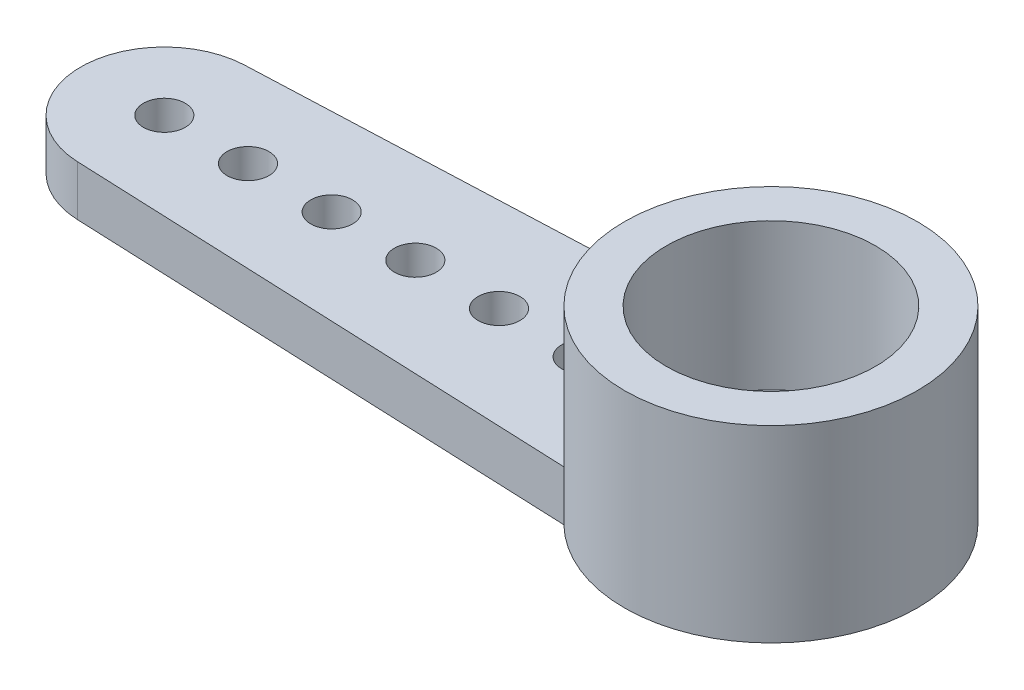
ISO-10303-21;
HEADER;
FILE_DESCRIPTION(('STEP AP214'),'2;1');
FILE_NAME('part.step','',(''),(''),'','','');
FILE_SCHEMA(('AUTOMOTIVE_DESIGN { 1 0 10303 214 1 1 1 1 }'));
ENDSEC;
DATA;
#1=APPLICATION_CONTEXT('core data for automotive mechanical design processes');
#2=APPLICATION_PROTOCOL_DEFINITION('international standard','automotive_design',2000,#1);
#3=PRODUCT_CONTEXT('',#1,'mechanical');
#4=PRODUCT('Part','Part','',(#3));
#5=PRODUCT_RELATED_PRODUCT_CATEGORY('part','',(#4));
#6=PRODUCT_DEFINITION_FORMATION('','',#4);
#7=PRODUCT_DEFINITION_CONTEXT('part definition',#1,'design');
#8=PRODUCT_DEFINITION('design','',#6,#7);
#9=PRODUCT_DEFINITION_SHAPE('','',#8);
#10=(LENGTH_UNIT() NAMED_UNIT(*) SI_UNIT(.MILLI.,.METRE.));
#11=(NAMED_UNIT(*) PLANE_ANGLE_UNIT() SI_UNIT($,.RADIAN.));
#12=(NAMED_UNIT(*) SI_UNIT($,.STERADIAN.) SOLID_ANGLE_UNIT());
#13=UNCERTAINTY_MEASURE_WITH_UNIT(LENGTH_MEASURE(1.E-05),#10,'distance_accuracy_value','');
#14=(GEOMETRIC_REPRESENTATION_CONTEXT(3) GLOBAL_UNCERTAINTY_ASSIGNED_CONTEXT((#13)) GLOBAL_UNIT_ASSIGNED_CONTEXT((#10,
#11,#12)) REPRESENTATION_CONTEXT('',''));
#15=CARTESIAN_POINT('',(0.,0.,0.));
#16=DIRECTION('',(0.,0.,1.));
#17=DIRECTION('',(1.,0.,0.));
#18=AXIS2_PLACEMENT_3D('',#15,#16,#17);
#19=CARTESIAN_POINT('',(-0.0955347726602722,1.2,-2.30341215095561));
#20=DIRECTION('',(-0.0414397001813394,0.,-0.999141006689687));
#21=DIRECTION('',(-0.999141006689687,0.,0.0414397001813394));
#22=AXIS2_PLACEMENT_3D('',#19,#20,#21);
#23=PLANE('',#22);
#24=DIRECTION('',(0.999141006689687,0.,-0.0414397001813394));
#25=VECTOR('',#24,1.);
#26=CARTESIAN_POINT('',(-0.0955347726602722,0.,-2.30341215095561));
#27=LINE('',#26,#25);
#28=CARTESIAN_POINT('',(-7.45244207399663,0.,-1.99828201337937));
#29=VERTEX_POINT('',#28);
#30=CARTESIAN_POINT('',(4.68256680281766,0.,-2.50158547724097));
#31=VERTEX_POINT('',#30);
#32=EDGE_CURVE('E84',#29,#31,#27,.T.);
#33=ORIENTED_EDGE('',*,*,#32,.F.);
#34=DIRECTION('',(0.,-1.,0.));
#35=VECTOR('',#34,1.);
#36=CARTESIAN_POINT('',(-7.45244207399663,1.2,-1.99828201337937));
#37=LINE('',#36,#35);
#38=CARTESIAN_POINT('',(-7.45244207399663,1.2,-1.99828201337937));
#39=VERTEX_POINT('',#38);
#40=EDGE_CURVE('E126',#39,#29,#37,.T.);
#41=ORIENTED_EDGE('',*,*,#40,.F.);
#42=DIRECTION('',(0.999141006689687,0.,-0.0414397001813394));
#43=VECTOR('',#42,1.);
#44=CARTESIAN_POINT('',(-0.0955347726602722,1.2,-2.30341215095561));
#45=LINE('',#44,#43);
#46=CARTESIAN_POINT('',(4.68256680281766,1.2,-2.50158547724097));
#47=VERTEX_POINT('',#46);
#48=EDGE_CURVE('E130',#39,#47,#45,.T.);
#49=ORIENTED_EDGE('',*,*,#48,.T.);
#50=DIRECTION('',(0.,-1.,0.));
#51=VECTOR('',#50,1.);
#52=CARTESIAN_POINT('',(4.68256680281766,1.2,-2.50158547724097));
#53=LINE('',#52,#51);
#54=EDGE_CURVE('E52',#47,#31,#53,.T.);
#55=ORIENTED_EDGE('',*,*,#54,.T.);
#56=EDGE_LOOP('',(#33,#41,#49,#55));
#57=FACE_BOUND('',#56,.T.);
#58=ADVANCED_FACE('F43',(#57),#23,.T.);
#59=CARTESIAN_POINT('',(-7.36956267363395,1.2,0.));
#60=DIRECTION('',(0.,-1.,0.));
#61=DIRECTION('',(0.,0.,-1.));
#62=AXIS2_PLACEMENT_3D('',#59,#60,#61);
#63=CYLINDRICAL_SURFACE('',#62,2.);
#64=CARTESIAN_POINT('',(-7.36956267363395,0.,0.));
#65=DIRECTION('',(0.,1.,0.));
#66=DIRECTION('',(0.,0.,1.));
#67=AXIS2_PLACEMENT_3D('',#64,#65,#66);
#68=CIRCLE('',#67,2.);
#69=CARTESIAN_POINT('',(-7.45244207399663,0.,1.99828201337937));
#70=VERTEX_POINT('',#69);
#71=EDGE_CURVE('E105',#29,#70,#68,.T.);
#72=ORIENTED_EDGE('',*,*,#71,.T.);
#73=DIRECTION('',(0.,-1.,0.));
#74=VECTOR('',#73,1.);
#75=CARTESIAN_POINT('',(-7.45244207399663,1.2,1.99828201337937));
#76=LINE('',#75,#74);
#77=CARTESIAN_POINT('',(-7.45244207399663,1.2,1.99828201337937));
#78=VERTEX_POINT('',#77);
#79=EDGE_CURVE('E98',#78,#70,#76,.T.);
#80=ORIENTED_EDGE('',*,*,#79,.F.);
#81=CARTESIAN_POINT('',(-7.36956267363395,1.2,0.));
#82=DIRECTION('',(0.,1.,0.));
#83=DIRECTION('',(0.,0.,1.));
#84=AXIS2_PLACEMENT_3D('',#81,#82,#83);
#85=CIRCLE('',#84,2.);
#86=EDGE_CURVE('E136',#39,#78,#85,.T.);
#87=ORIENTED_EDGE('',*,*,#86,.F.);
#88=ORIENTED_EDGE('',*,*,#40,.T.);
#89=EDGE_LOOP('',(#72,#80,#87,#88));
#90=FACE_BOUND('',#89,.T.);
#91=ADVANCED_FACE('F201',(#90),#63,.T.);
#92=CARTESIAN_POINT('',(-3.36956267363395,1.2,0.));
#93=DIRECTION('',(0.,-1.,0.));
#94=DIRECTION('',(0.,0.,-1.));
#95=AXIS2_PLACEMENT_3D('',#92,#93,#94);
#96=CYLINDRICAL_SURFACE('',#95,0.500000000000001);
#97=CARTESIAN_POINT('',(-3.36956267363395,1.2,0.));
#98=DIRECTION('',(0.,1.,0.));
#99=DIRECTION('',(0.,0.,1.));
#100=AXIS2_PLACEMENT_3D('',#97,#98,#99);
#101=CIRCLE('',#100,0.500000000000001);
#102=CARTESIAN_POINT('',(-3.36956267363395,1.2,0.500000000000001));
#103=VERTEX_POINT('',#102);
#104=EDGE_CURVE('E152',#103,#103,#101,.T.);
#105=ORIENTED_EDGE('',*,*,#104,.T.);
#106=EDGE_LOOP('',(#105));
#107=FACE_BOUND('',#106,.T.);
#108=CARTESIAN_POINT('',(-3.36956267363395,0.,0.));
#109=DIRECTION('',(0.,1.,0.));
#110=DIRECTION('',(0.,0.,1.));
#111=AXIS2_PLACEMENT_3D('',#108,#109,#110);
#112=CIRCLE('',#111,0.500000000000001);
#113=CARTESIAN_POINT('',(-3.36956267363395,0.,0.500000000000001));
#114=VERTEX_POINT('',#113);
#115=EDGE_CURVE('E118',#114,#114,#112,.T.);
#116=ORIENTED_EDGE('',*,*,#115,.F.);
#117=EDGE_LOOP('',(#116));
#118=FACE_BOUND('',#117,.T.);
#119=ADVANCED_FACE('F205',(#107,#118),#96,.F.);
#120=CARTESIAN_POINT('',(-1.36956267363395,1.2,0.));
#121=DIRECTION('',(0.,-1.,0.));
#122=DIRECTION('',(0.,0.,-1.));
#123=AXIS2_PLACEMENT_3D('',#120,#121,#122);
#124=CYLINDRICAL_SURFACE('',#123,0.500000000000001);
#125=CARTESIAN_POINT('',(-1.36956267363395,1.2,0.));
#126=DIRECTION('',(0.,1.,0.));
#127=DIRECTION('',(0.,0.,1.));
#128=AXIS2_PLACEMENT_3D('',#125,#126,#127);
#129=CIRCLE('',#128,0.500000000000001);
#130=CARTESIAN_POINT('',(-1.36956267363395,1.2,0.500000000000001));
#131=VERTEX_POINT('',#130);
#132=EDGE_CURVE('E149',#131,#131,#129,.T.);
#133=ORIENTED_EDGE('',*,*,#132,.T.);
#134=EDGE_LOOP('',(#133));
#135=FACE_BOUND('',#134,.T.);
#136=CARTESIAN_POINT('',(-1.36956267363395,0.,0.));
#137=DIRECTION('',(0.,1.,0.));
#138=DIRECTION('',(0.,0.,1.));
#139=AXIS2_PLACEMENT_3D('',#136,#137,#138);
#140=CIRCLE('',#139,0.500000000000001);
#141=CARTESIAN_POINT('',(-1.36956267363395,0.,0.500000000000001));
#142=VERTEX_POINT('',#141);
#143=EDGE_CURVE('E115',#142,#142,#140,.T.);
#144=ORIENTED_EDGE('',*,*,#143,.F.);
#145=EDGE_LOOP('',(#144));
#146=FACE_BOUND('',#145,.T.);
#147=ADVANCED_FACE('F218',(#135,#146),#124,.F.);
#148=CARTESIAN_POINT('',(0.630437326366053,1.2,0.));
#149=DIRECTION('',(0.,-1.,0.));
#150=DIRECTION('',(0.,0.,-1.));
#151=AXIS2_PLACEMENT_3D('',#148,#149,#150);
#152=CYLINDRICAL_SURFACE('',#151,0.500000000000001);
#153=CARTESIAN_POINT('',(0.630437326366053,1.2,0.));
#154=DIRECTION('',(0.,1.,0.));
#155=DIRECTION('',(0.,0.,1.));
#156=AXIS2_PLACEMENT_3D('',#153,#154,#155);
#157=CIRCLE('',#156,0.500000000000001);
#158=CARTESIAN_POINT('',(0.630437326366053,1.2,0.500000000000001));
#159=VERTEX_POINT('',#158);
#160=EDGE_CURVE('E146',#159,#159,#157,.T.);
#161=ORIENTED_EDGE('',*,*,#160,.T.);
#162=EDGE_LOOP('',(#161));
#163=FACE_BOUND('',#162,.T.);
#164=CARTESIAN_POINT('',(0.630437326366053,0.,0.));
#165=DIRECTION('',(0.,1.,0.));
#166=DIRECTION('',(0.,0.,1.));
#167=AXIS2_PLACEMENT_3D('',#164,#165,#166);
#168=CIRCLE('',#167,0.500000000000001);
#169=CARTESIAN_POINT('',(0.630437326366053,0.,0.500000000000001));
#170=VERTEX_POINT('',#169);
#171=EDGE_CURVE('E108',#170,#170,#168,.T.);
#172=ORIENTED_EDGE('',*,*,#171,.F.);
#173=EDGE_LOOP('',(#172));
#174=FACE_BOUND('',#173,.T.);
#175=ADVANCED_FACE('F214',(#163,#174),#152,.F.);
#176=CARTESIAN_POINT('',(2.63043732636605,1.2,0.));
#177=DIRECTION('',(0.,-1.,0.));
#178=DIRECTION('',(0.,0.,-1.));
#179=AXIS2_PLACEMENT_3D('',#176,#177,#178);
#180=CYLINDRICAL_SURFACE('',#179,0.500000000000001);
#181=CARTESIAN_POINT('',(2.63043732636605,1.2,0.));
#182=DIRECTION('',(0.,1.,0.));
#183=DIRECTION('',(0.,0.,1.));
#184=AXIS2_PLACEMENT_3D('',#181,#182,#183);
#185=CIRCLE('',#184,0.500000000000001);
#186=CARTESIAN_POINT('',(2.63043732636605,1.2,0.500000000000001));
#187=VERTEX_POINT('',#186);
#188=EDGE_CURVE('E143',#187,#187,#185,.T.);
#189=ORIENTED_EDGE('',*,*,#188,.T.);
#190=EDGE_LOOP('',(#189));
#191=FACE_BOUND('',#190,.T.);
#192=CARTESIAN_POINT('',(2.63043732636605,0.,0.));
#193=DIRECTION('',(0.,1.,0.));
#194=DIRECTION('',(0.,0.,1.));
#195=AXIS2_PLACEMENT_3D('',#192,#193,#194);
#196=CIRCLE('',#195,0.500000000000001);
#197=CARTESIAN_POINT('',(2.63043732636605,0.,0.500000000000001));
#198=VERTEX_POINT('',#197);
#199=EDGE_CURVE('E104',#198,#198,#196,.T.);
#200=ORIENTED_EDGE('',*,*,#199,.F.);
#201=EDGE_LOOP('',(#200));
#202=FACE_BOUND('',#201,.T.);
#203=ADVANCED_FACE('F211',(#191,#202),#180,.F.);
#204=CARTESIAN_POINT('',(-0.0955347726602721,1.2,2.30341215095561));
#205=DIRECTION('',(0.0414397001813394,0.,-0.999141006689687));
#206=DIRECTION('',(-0.999141006689687,0.,-0.0414397001813394));
#207=AXIS2_PLACEMENT_3D('',#204,#205,#206);
#208=PLANE('',#207);
#209=DIRECTION('',(0.999141006689687,0.,0.0414397001813394));
#210=VECTOR('',#209,1.);
#211=CARTESIAN_POINT('',(-0.0955347726602721,0.,2.30341215095561));
#212=LINE('',#211,#210);
#213=CARTESIAN_POINT('',(4.68256680281766,0.,2.50158547724096));
#214=VERTEX_POINT('',#213);
#215=EDGE_CURVE('E75',#70,#214,#212,.T.);
#216=ORIENTED_EDGE('',*,*,#215,.T.);
#217=DIRECTION('',(0.,-1.,0.));
#218=VECTOR('',#217,1.);
#219=CARTESIAN_POINT('',(4.68256680281766,1.2,2.50158547724096));
#220=LINE('',#219,#218);
#221=CARTESIAN_POINT('',(4.68256680281766,1.2,2.50158547724097));
#222=VERTEX_POINT('',#221);
#223=EDGE_CURVE('E92',#222,#214,#220,.T.);
#224=ORIENTED_EDGE('',*,*,#223,.F.);
#225=DIRECTION('',(0.999141006689687,0.,0.0414397001813394));
#226=VECTOR('',#225,1.);
#227=CARTESIAN_POINT('',(-0.0955347726602721,1.2,2.30341215095561));
#228=LINE('',#227,#226);
#229=EDGE_CURVE('E60',#78,#222,#228,.T.);
#230=ORIENTED_EDGE('',*,*,#229,.F.);
#231=ORIENTED_EDGE('',*,*,#79,.T.);
#232=EDGE_LOOP('',(#216,#224,#230,#231));
#233=FACE_BOUND('',#232,.T.);
#234=ADVANCED_FACE('F101',(#233),#208,.F.);
#235=CARTESIAN_POINT('',(-7.36956267363395,1.2,0.));
#236=DIRECTION('',(0.,-1.,0.));
#237=DIRECTION('',(0.,0.,-1.));
#238=AXIS2_PLACEMENT_3D('',#235,#236,#237);
#239=CYLINDRICAL_SURFACE('',#238,0.500000000000001);
#240=CARTESIAN_POINT('',(-7.36956267363395,1.2,0.));
#241=DIRECTION('',(0.,1.,0.));
#242=DIRECTION('',(0.,0.,1.));
#243=AXIS2_PLACEMENT_3D('',#240,#241,#242);
#244=CIRCLE('',#243,0.500000000000001);
#245=CARTESIAN_POINT('',(-7.36956267363395,1.2,0.500000000000001));
#246=VERTEX_POINT('',#245);
#247=EDGE_CURVE('E123',#246,#246,#244,.T.);
#248=ORIENTED_EDGE('',*,*,#247,.T.);
#249=EDGE_LOOP('',(#248));
#250=FACE_BOUND('',#249,.T.);
#251=CARTESIAN_POINT('',(-7.36956267363395,0.,0.));
#252=DIRECTION('',(0.,1.,0.));
#253=DIRECTION('',(0.,0.,1.));
#254=AXIS2_PLACEMENT_3D('',#251,#252,#253);
#255=CIRCLE('',#254,0.500000000000001);
#256=CARTESIAN_POINT('',(-7.36956267363395,0.,0.500000000000001));
#257=VERTEX_POINT('',#256);
#258=EDGE_CURVE('E157',#257,#257,#255,.T.);
#259=ORIENTED_EDGE('',*,*,#258,.F.);
#260=EDGE_LOOP('',(#259));
#261=FACE_BOUND('',#260,.T.);
#262=ADVANCED_FACE('F45',(#250,#261),#239,.F.);
#263=CARTESIAN_POINT('',(-5.36956267363395,1.2,0.));
#264=DIRECTION('',(0.,-1.,0.));
#265=DIRECTION('',(0.,0.,-1.));
#266=AXIS2_PLACEMENT_3D('',#263,#264,#265);
#267=CYLINDRICAL_SURFACE('',#266,0.500000000000001);
#268=CARTESIAN_POINT('',(-5.36956267363395,1.2,0.));
#269=DIRECTION('',(0.,1.,0.));
#270=DIRECTION('',(0.,0.,1.));
#271=AXIS2_PLACEMENT_3D('',#268,#269,#270);
#272=CIRCLE('',#271,0.500000000000001);
#273=CARTESIAN_POINT('',(-5.36956267363395,1.2,0.500000000000001));
#274=VERTEX_POINT('',#273);
#275=EDGE_CURVE('E99',#274,#274,#272,.T.);
#276=ORIENTED_EDGE('',*,*,#275,.T.);
#277=EDGE_LOOP('',(#276));
#278=FACE_BOUND('',#277,.T.);
#279=CARTESIAN_POINT('',(-5.36956267363395,0.,0.));
#280=DIRECTION('',(0.,1.,0.));
#281=DIRECTION('',(0.,0.,1.));
#282=AXIS2_PLACEMENT_3D('',#279,#280,#281);
#283=CIRCLE('',#282,0.500000000000001);
#284=CARTESIAN_POINT('',(-5.36956267363395,0.,0.500000000000001));
#285=VERTEX_POINT('',#284);
#286=EDGE_CURVE('E121',#285,#285,#283,.T.);
#287=ORIENTED_EDGE('',*,*,#286,.F.);
#288=EDGE_LOOP('',(#287));
#289=FACE_BOUND('',#288,.T.);
#290=ADVANCED_FACE('F226',(#278,#289),#267,.F.);
#291=CARTESIAN_POINT('',(0.,1.2,0.));
#292=DIRECTION('',(0.,1.,0.));
#293=DIRECTION('',(0.,0.,1.));
#294=AXIS2_PLACEMENT_3D('',#291,#292,#293);
#295=PLANE('',#294);
#296=ORIENTED_EDGE('',*,*,#247,.F.);
#297=EDGE_LOOP('',(#296));
#298=FACE_BOUND('',#297,.T.);
#299=CARTESIAN_POINT('',(7.13043732636605,1.2,0.));
#300=DIRECTION('',(0.,1.,0.));
#301=DIRECTION('',(0.,0.,1.));
#302=AXIS2_PLACEMENT_3D('',#299,#300,#301);
#303=CIRCLE('',#302,3.5);
#304=EDGE_CURVE('E97',#47,#222,#303,.T.);
#305=ORIENTED_EDGE('',*,*,#304,.F.);
#306=ORIENTED_EDGE('',*,*,#48,.F.);
#307=ORIENTED_EDGE('',*,*,#86,.T.);
#308=ORIENTED_EDGE('',*,*,#229,.T.);
#309=EDGE_LOOP('',(#305,#306,#307,#308));
#310=FACE_BOUND('',#309,.T.);
#311=ORIENTED_EDGE('',*,*,#188,.F.);
#312=EDGE_LOOP('',(#311));
#313=FACE_BOUND('',#312,.T.);
#314=ORIENTED_EDGE('',*,*,#160,.F.);
#315=EDGE_LOOP('',(#314));
#316=FACE_BOUND('',#315,.T.);
#317=ORIENTED_EDGE('',*,*,#132,.F.);
#318=EDGE_LOOP('',(#317));
#319=FACE_BOUND('',#318,.T.);
#320=ORIENTED_EDGE('',*,*,#104,.F.);
#321=EDGE_LOOP('',(#320));
#322=FACE_BOUND('',#321,.T.);
#323=ORIENTED_EDGE('',*,*,#275,.F.);
#324=EDGE_LOOP('',(#323));
#325=FACE_BOUND('',#324,.T.);
#326=ADVANCED_FACE('F133',(#298,#310,#313,#316,#319,#322,#325),#295,.T.);
#327=CARTESIAN_POINT('',(0.,0.,0.));
#328=DIRECTION('',(0.,1.,0.));
#329=DIRECTION('',(0.,0.,1.));
#330=AXIS2_PLACEMENT_3D('',#327,#328,#329);
#331=PLANE('',#330);
#332=CARTESIAN_POINT('',(7.13043732636605,0.,0.));
#333=DIRECTION('',(0.,1.,0.));
#334=DIRECTION('',(0.,0.,1.));
#335=AXIS2_PLACEMENT_3D('',#332,#333,#334);
#336=CIRCLE('',#335,1.25);
#337=CARTESIAN_POINT('',(7.13043732636605,0.,1.25));
#338=VERTEX_POINT('',#337);
#339=EDGE_CURVE('E169',#338,#338,#336,.T.);
#340=ORIENTED_EDGE('',*,*,#339,.T.);
#341=EDGE_LOOP('',(#340));
#342=FACE_BOUND('',#341,.T.);
#343=ORIENTED_EDGE('',*,*,#258,.T.);
#344=EDGE_LOOP('',(#343));
#345=FACE_BOUND('',#344,.T.);
#346=ORIENTED_EDGE('',*,*,#32,.T.);
#347=CARTESIAN_POINT('',(7.13043732636605,0.,0.));
#348=DIRECTION('',(0.,1.,0.));
#349=DIRECTION('',(0.,0.,1.));
#350=AXIS2_PLACEMENT_3D('',#347,#348,#349);
#351=CIRCLE('',#350,3.5);
#352=EDGE_CURVE('E78',#214,#31,#351,.T.);
#353=ORIENTED_EDGE('',*,*,#352,.F.);
#354=ORIENTED_EDGE('',*,*,#215,.F.);
#355=ORIENTED_EDGE('',*,*,#71,.F.);
#356=EDGE_LOOP('',(#346,#353,#354,#355));
#357=FACE_BOUND('',#356,.T.);
#358=ORIENTED_EDGE('',*,*,#199,.T.);
#359=EDGE_LOOP('',(#358));
#360=FACE_BOUND('',#359,.T.);
#361=ORIENTED_EDGE('',*,*,#171,.T.);
#362=EDGE_LOOP('',(#361));
#363=FACE_BOUND('',#362,.T.);
#364=ORIENTED_EDGE('',*,*,#143,.T.);
#365=EDGE_LOOP('',(#364));
#366=FACE_BOUND('',#365,.T.);
#367=ORIENTED_EDGE('',*,*,#115,.T.);
#368=EDGE_LOOP('',(#367));
#369=FACE_BOUND('',#368,.T.);
#370=ORIENTED_EDGE('',*,*,#286,.T.);
#371=EDGE_LOOP('',(#370));
#372=FACE_BOUND('',#371,.T.);
#373=ADVANCED_FACE('F80',(#342,#345,#357,#360,#363,#366,#369,#372),#331,.F.);
#374=CARTESIAN_POINT('',(7.13043732636605,4.5,0.));
#375=DIRECTION('',(0.,1.,0.));
#376=DIRECTION('',(0.,0.,1.));
#377=AXIS2_PLACEMENT_3D('',#374,#375,#376);
#378=PLANE('',#377);
#379=CARTESIAN_POINT('',(7.13043732636605,4.5,0.));
#380=DIRECTION('',(0.,1.,0.));
#381=DIRECTION('',(0.,0.,1.));
#382=AXIS2_PLACEMENT_3D('',#379,#380,#381);
#383=CIRCLE('',#382,3.5);
#384=CARTESIAN_POINT('',(7.13043732636605,4.5,3.5));
#385=VERTEX_POINT('',#384);
#386=EDGE_CURVE('E88',#385,#385,#383,.T.);
#387=ORIENTED_EDGE('',*,*,#386,.T.);
#388=EDGE_LOOP('',(#387));
#389=FACE_BOUND('',#388,.T.);
#390=CARTESIAN_POINT('',(7.13043732636605,4.5,0.));
#391=DIRECTION('',(0.,1.,0.));
#392=DIRECTION('',(0.,0.,1.));
#393=AXIS2_PLACEMENT_3D('',#390,#391,#392);
#394=CIRCLE('',#393,2.5);
#395=CARTESIAN_POINT('',(7.13043732636605,4.5,2.5));
#396=VERTEX_POINT('',#395);
#397=EDGE_CURVE('E89',#396,#396,#394,.T.);
#398=ORIENTED_EDGE('',*,*,#397,.F.);
#399=EDGE_LOOP('',(#398));
#400=FACE_BOUND('',#399,.T.);
#401=ADVANCED_FACE('F190',(#389,#400),#378,.T.);
#402=CARTESIAN_POINT('',(7.13043732636605,4.5,0.));
#403=DIRECTION('',(0.,-1.,0.));
#404=DIRECTION('',(0.,0.,-1.));
#405=AXIS2_PLACEMENT_3D('',#402,#403,#404);
#406=CYLINDRICAL_SURFACE('',#405,3.5);
#407=ORIENTED_EDGE('',*,*,#54,.F.);
#408=ORIENTED_EDGE('',*,*,#304,.T.);
#409=ORIENTED_EDGE('',*,*,#223,.T.);
#410=ORIENTED_EDGE('',*,*,#352,.T.);
#411=EDGE_LOOP('',(#407,#408,#409,#410));
#412=FACE_BOUND('',#411,.T.);
#413=ORIENTED_EDGE('',*,*,#386,.F.);
#414=EDGE_LOOP('',(#413));
#415=FACE_BOUND('',#414,.T.);
#416=ADVANCED_FACE('F93',(#412,#415),#406,.T.);
#417=CARTESIAN_POINT('',(7.13043732636605,4.5,0.));
#418=DIRECTION('',(0.,-1.,0.));
#419=DIRECTION('',(0.,0.,-1.));
#420=AXIS2_PLACEMENT_3D('',#417,#418,#419);
#421=CYLINDRICAL_SURFACE('',#420,2.5);
#422=CARTESIAN_POINT('',(7.13043732636605,1.,0.));
#423=DIRECTION('',(0.,1.,0.));
#424=DIRECTION('',(0.,0.,1.));
#425=AXIS2_PLACEMENT_3D('',#422,#423,#424);
#426=CIRCLE('',#425,2.5);
#427=CARTESIAN_POINT('',(7.13043732636605,1.,2.5));
#428=VERTEX_POINT('',#427);
#429=EDGE_CURVE('E12',#428,#428,#426,.T.);
#430=ORIENTED_EDGE('',*,*,#429,.F.);
#431=EDGE_LOOP('',(#430));
#432=FACE_BOUND('',#431,.T.);
#433=ORIENTED_EDGE('',*,*,#397,.T.);
#434=EDGE_LOOP('',(#433));
#435=FACE_BOUND('',#434,.T.);
#436=ADVANCED_FACE('F181',(#432,#435),#421,.F.);
#437=CARTESIAN_POINT('',(7.13043732636605,1.,0.));
#438=DIRECTION('',(0.,1.,0.));
#439=DIRECTION('',(0.,0.,1.));
#440=AXIS2_PLACEMENT_3D('',#437,#438,#439);
#441=PLANE('',#440);
#442=CARTESIAN_POINT('',(7.13043732636605,1.,0.));
#443=DIRECTION('',(0.,1.,0.));
#444=DIRECTION('',(0.,0.,1.));
#445=AXIS2_PLACEMENT_3D('',#442,#443,#444);
#446=CIRCLE('',#445,1.25);
#447=CARTESIAN_POINT('',(7.13043732636605,1.,1.25));
#448=VERTEX_POINT('',#447);
#449=EDGE_CURVE('E168',#448,#448,#446,.T.);
#450=ORIENTED_EDGE('',*,*,#449,.F.);
#451=EDGE_LOOP('',(#450));
#452=FACE_BOUND('',#451,.T.);
#453=ORIENTED_EDGE('',*,*,#429,.T.);
#454=EDGE_LOOP('',(#453));
#455=FACE_BOUND('',#454,.T.);
#456=ADVANCED_FACE('F178',(#452,#455),#441,.T.);
#457=CARTESIAN_POINT('',(7.13043732636605,1.,0.));
#458=DIRECTION('',(0.,-1.,0.));
#459=DIRECTION('',(0.,0.,-1.));
#460=AXIS2_PLACEMENT_3D('',#457,#458,#459);
#461=CYLINDRICAL_SURFACE('',#460,1.25);
#462=ORIENTED_EDGE('',*,*,#449,.T.);
#463=EDGE_LOOP('',(#462));
#464=FACE_BOUND('',#463,.T.);
#465=ORIENTED_EDGE('',*,*,#339,.F.);
#466=EDGE_LOOP('',(#465));
#467=FACE_BOUND('',#466,.T.);
#468=ADVANCED_FACE('F175',(#464,#467),#461,.F.);
#469=CLOSED_SHELL('',(#58,#91,#119,#147,#175,#203,#234,#262,#290,#326,#373,#401,#416,#436,#456,#468));
#470=MANIFOLD_SOLID_BREP('B2',#469);
#471=ADVANCED_BREP_SHAPE_REPRESENTATION('',(#18,#470),#14);
#472=SHAPE_DEFINITION_REPRESENTATION(#9,#471);
ENDSEC;
END-ISO-10303-21;
